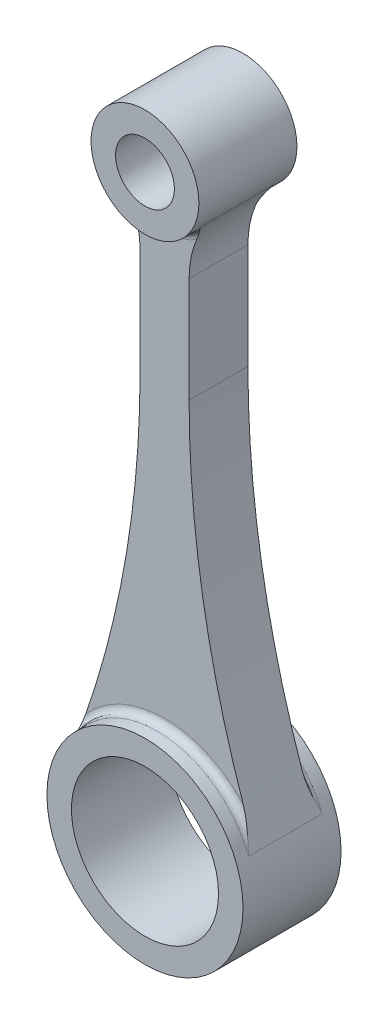
ISO-10303-21;
HEADER;
FILE_DESCRIPTION(('STEP AP214'),'2;1');
FILE_NAME('part.step','',(''),(''),'','','');
FILE_SCHEMA(('AUTOMOTIVE_DESIGN { 1 0 10303 214 1 1 1 1 }'));
ENDSEC;
DATA;
#1=APPLICATION_CONTEXT('core data for automotive mechanical design processes');
#2=APPLICATION_PROTOCOL_DEFINITION('international standard','automotive_design',2000,#1);
#3=PRODUCT_CONTEXT('',#1,'mechanical');
#4=PRODUCT('Part','Part','',(#3));
#5=PRODUCT_RELATED_PRODUCT_CATEGORY('part','',(#4));
#6=PRODUCT_DEFINITION_FORMATION('','',#4);
#7=PRODUCT_DEFINITION_CONTEXT('part definition',#1,'design');
#8=PRODUCT_DEFINITION('design','',#6,#7);
#9=PRODUCT_DEFINITION_SHAPE('','',#8);
#10=(LENGTH_UNIT() NAMED_UNIT(*) SI_UNIT(.MILLI.,.METRE.));
#11=(NAMED_UNIT(*) PLANE_ANGLE_UNIT() SI_UNIT($,.RADIAN.));
#12=(NAMED_UNIT(*) SI_UNIT($,.STERADIAN.) SOLID_ANGLE_UNIT());
#13=UNCERTAINTY_MEASURE_WITH_UNIT(LENGTH_MEASURE(1.E-05),#10,'distance_accuracy_value','');
#14=(GEOMETRIC_REPRESENTATION_CONTEXT(3) GLOBAL_UNCERTAINTY_ASSIGNED_CONTEXT((#13)) GLOBAL_UNIT_ASSIGNED_CONTEXT((#10,
#11,#12)) REPRESENTATION_CONTEXT('',''));
#15=CARTESIAN_POINT('',(0.,0.,0.));
#16=DIRECTION('',(0.,0.,1.));
#17=DIRECTION('',(1.,0.,0.));
#18=AXIS2_PLACEMENT_3D('',#15,#16,#17);
#19=CARTESIAN_POINT('',(0.,0.,10.));
#20=DIRECTION('',(0.,0.,1.));
#21=DIRECTION('',(1.,0.,0.));
#22=AXIS2_PLACEMENT_3D('',#19,#20,#21);
#23=PLANE('',#22);
#24=CARTESIAN_POINT('',(0.,0.,10.));
#25=DIRECTION('',(0.,0.,1.));
#26=DIRECTION('',(1.,0.,0.));
#27=AXIS2_PLACEMENT_3D('',#24,#25,#26);
#28=CIRCLE('',#27,20.);
#29=CARTESIAN_POINT('',(20.,0.,10.));
#30=VERTEX_POINT('',#29);
#31=EDGE_CURVE('E194',#30,#30,#28,.T.);
#32=ORIENTED_EDGE('',*,*,#31,.T.);
#33=EDGE_LOOP('',(#32));
#34=FACE_BOUND('',#33,.T.);
#35=CARTESIAN_POINT('',(0.,0.,10.));
#36=DIRECTION('',(0.,0.,1.));
#37=DIRECTION('',(1.,0.,0.));
#38=AXIS2_PLACEMENT_3D('',#35,#36,#37);
#39=CIRCLE('',#38,15.);
#40=CARTESIAN_POINT('',(15.,0.,10.));
#41=VERTEX_POINT('',#40);
#42=EDGE_CURVE('E188',#41,#41,#39,.T.);
#43=ORIENTED_EDGE('',*,*,#42,.F.);
#44=EDGE_LOOP('',(#43));
#45=FACE_BOUND('',#44,.T.);
#46=ADVANCED_FACE('F44',(#34,#45),#23,.T.);
#47=CARTESIAN_POINT('',(0.,0.,-10.));
#48=DIRECTION('',(0.,0.,1.));
#49=DIRECTION('',(1.,0.,0.));
#50=AXIS2_PLACEMENT_3D('',#47,#48,#49);
#51=PLANE('',#50);
#52=CARTESIAN_POINT('',(0.,0.,-10.));
#53=DIRECTION('',(0.,0.,1.));
#54=DIRECTION('',(1.,0.,0.));
#55=AXIS2_PLACEMENT_3D('',#52,#53,#54);
#56=CIRCLE('',#55,20.);
#57=CARTESIAN_POINT('',(20.,0.,-10.));
#58=VERTEX_POINT('',#57);
#59=EDGE_CURVE('E191',#58,#58,#56,.T.);
#60=ORIENTED_EDGE('',*,*,#59,.F.);
#61=EDGE_LOOP('',(#60));
#62=FACE_BOUND('',#61,.T.);
#63=CARTESIAN_POINT('',(0.,0.,-10.));
#64=DIRECTION('',(0.,0.,1.));
#65=DIRECTION('',(1.,0.,0.));
#66=AXIS2_PLACEMENT_3D('',#63,#64,#65);
#67=CIRCLE('',#66,15.);
#68=CARTESIAN_POINT('',(15.,0.,-10.));
#69=VERTEX_POINT('',#68);
#70=EDGE_CURVE('E160',#69,#69,#67,.T.);
#71=ORIENTED_EDGE('',*,*,#70,.T.);
#72=EDGE_LOOP('',(#71));
#73=FACE_BOUND('',#72,.T.);
#74=ADVANCED_FACE('F344',(#62,#73),#51,.F.);
#75=CARTESIAN_POINT('',(0.,0.,10.));
#76=DIRECTION('',(0.,0.,-1.));
#77=DIRECTION('',(-1.,0.,0.));
#78=AXIS2_PLACEMENT_3D('',#75,#76,#77);
#79=CYLINDRICAL_SURFACE('',#78,20.);
#80=CARTESIAN_POINT('',(0.,0.,7.5));
#81=DIRECTION('',(0.,0.,1.));
#82=DIRECTION('',(1.,0.,0.));
#83=AXIS2_PLACEMENT_3D('',#80,#81,#82);
#84=CIRCLE('',#83,20.);
#85=CARTESIAN_POINT('',(18.6481142651052,7.2282663450912,7.5));
#86=VERTEX_POINT('',#85);
#87=CARTESIAN_POINT('',(-18.6481142651052,7.2282663450912,7.5));
#88=VERTEX_POINT('',#87);
#89=EDGE_CURVE('E208',#86,#88,#84,.T.);
#90=ORIENTED_EDGE('',*,*,#89,.T.);
#91=DIRECTION('',(0.,0.,-1.));
#92=VECTOR('',#91,1.);
#93=CARTESIAN_POINT('',(-18.6481142651053,7.22826634509122,6.));
#94=LINE('',#93,#92);
#95=CARTESIAN_POINT('',(-18.6481142651052,7.2282663450912,-7.5));
#96=VERTEX_POINT('',#95);
#97=EDGE_CURVE('E161',#88,#96,#94,.T.);
#98=ORIENTED_EDGE('',*,*,#97,.T.);
#99=CARTESIAN_POINT('',(0.,0.,-7.5));
#100=DIRECTION('',(0.,0.,1.));
#101=DIRECTION('',(1.,0.,0.));
#102=AXIS2_PLACEMENT_3D('',#99,#100,#101);
#103=CIRCLE('',#102,20.);
#104=CARTESIAN_POINT('',(18.6481142651052,7.2282663450912,-7.5));
#105=VERTEX_POINT('',#104);
#106=EDGE_CURVE('E205',#96,#105,#103,.F.);
#107=ORIENTED_EDGE('',*,*,#106,.T.);
#108=DIRECTION('',(0.,0.,-1.));
#109=VECTOR('',#108,1.);
#110=CARTESIAN_POINT('',(18.6481142651052,7.2282663450912,6.));
#111=LINE('',#110,#109);
#112=EDGE_CURVE('E185',#86,#105,#111,.T.);
#113=ORIENTED_EDGE('',*,*,#112,.F.);
#114=EDGE_LOOP('',(#90,#98,#107,#113));
#115=FACE_BOUND('',#114,.T.);
#116=ORIENTED_EDGE('',*,*,#31,.F.);
#117=EDGE_LOOP('',(#116));
#118=FACE_BOUND('',#117,.T.);
#119=ORIENTED_EDGE('',*,*,#59,.T.);
#120=EDGE_LOOP('',(#119));
#121=FACE_BOUND('',#120,.T.);
#122=ADVANCED_FACE('F286',(#115,#118,#121),#79,.T.);
#123=CARTESIAN_POINT('',(0.,0.,10.));
#124=DIRECTION('',(0.,0.,-1.));
#125=DIRECTION('',(-1.,0.,0.));
#126=AXIS2_PLACEMENT_3D('',#123,#124,#125);
#127=CYLINDRICAL_SURFACE('',#126,15.);
#128=ORIENTED_EDGE('',*,*,#42,.T.);
#129=EDGE_LOOP('',(#128));
#130=FACE_BOUND('',#129,.T.);
#131=ORIENTED_EDGE('',*,*,#70,.F.);
#132=EDGE_LOOP('',(#131));
#133=FACE_BOUND('',#132,.T.);
#134=ADVANCED_FACE('F343',(#130,#133),#127,.F.);
#135=CARTESIAN_POINT('',(-4.99999999999999,0.,6.));
#136=DIRECTION('',(1.,0.,0.));
#137=DIRECTION('',(0.,1.,0.));
#138=AXIS2_PLACEMENT_3D('',#135,#136,#137);
#139=PLANE('',#138);
#140=DIRECTION('',(0.,-1.,0.));
#141=VECTOR('',#140,1.);
#142=CARTESIAN_POINT('',(-4.99999999999999,0.,6.));
#143=LINE('',#142,#141);
#144=CARTESIAN_POINT('',(-5.,101.669697220177,6.));
#145=VERTEX_POINT('',#144);
#146=CARTESIAN_POINT('',(-5.,80.2020410288673,6.));
#147=VERTEX_POINT('',#146);
#148=EDGE_CURVE('E139',#145,#147,#143,.T.);
#149=ORIENTED_EDGE('',*,*,#148,.F.);
#150=DIRECTION('',(0.,0.,1.));
#151=VECTOR('',#150,1.);
#152=CARTESIAN_POINT('',(-5.,101.669697220177,-7.5));
#153=LINE('',#152,#151);
#154=CARTESIAN_POINT('',(-5.,101.669697220177,-6.));
#155=VERTEX_POINT('',#154);
#156=EDGE_CURVE('E321',#145,#155,#153,.F.);
#157=ORIENTED_EDGE('',*,*,#156,.T.);
#158=DIRECTION('',(0.,-1.,0.));
#159=VECTOR('',#158,1.);
#160=CARTESIAN_POINT('',(-4.99999999999999,0.,-6.));
#161=LINE('',#160,#159);
#162=CARTESIAN_POINT('',(-5.,80.2020410288673,-6.));
#163=VERTEX_POINT('',#162);
#164=EDGE_CURVE('E156',#155,#163,#161,.T.);
#165=ORIENTED_EDGE('',*,*,#164,.T.);
#166=DIRECTION('',(0.,0.,-1.));
#167=VECTOR('',#166,1.);
#168=CARTESIAN_POINT('',(-5.,80.2020410288673,6.));
#169=LINE('',#168,#167);
#170=EDGE_CURVE('E153',#147,#163,#169,.T.);
#171=ORIENTED_EDGE('',*,*,#170,.F.);
#172=EDGE_LOOP('',(#149,#157,#165,#171));
#173=FACE_BOUND('',#172,.T.);
#174=ADVANCED_FACE('F154',(#173),#139,.F.);
#175=CARTESIAN_POINT('',(-206.912246173203,80.2020410288672,6.));
#176=DIRECTION('',(0.,0.,-1.));
#177=DIRECTION('',(-1.,0.,0.));
#178=AXIS2_PLACEMENT_3D('',#175,#176,#177);
#179=CYLINDRICAL_SURFACE('',#178,201.912246173203);
#180=CARTESIAN_POINT('',(-206.912246173203,80.2020410288672,-6.));
#181=DIRECTION('',(0.,0.,1.));
#182=DIRECTION('',(1.,0.,0.));
#183=AXIS2_PLACEMENT_3D('',#180,#181,#182);
#184=CIRCLE('',#183,201.912246173203);
#185=CARTESIAN_POINT('',(-16.0593915870727,14.2949621144324,-6.));
#186=VERTEX_POINT('',#185);
#187=EDGE_CURVE('E176',#163,#186,#184,.F.);
#188=ORIENTED_EDGE('',*,*,#187,.T.);
#189=CARTESIAN_POINT('',(-16.0593915870727,14.2949621144324,-6.));
#190=CARTESIAN_POINT('',(-16.1006536952666,14.1754753958456,-6.00001602232113));
#191=CARTESIAN_POINT('',(-16.1420221672799,14.0560452300231,-6.00236364174544));
#192=CARTESIAN_POINT('',(-16.2249250693908,13.8174294281519,-6.01122841546125));
#193=CARTESIAN_POINT('',(-16.2664594535393,13.6982437365956,-6.01774448543616));
#194=CARTESIAN_POINT('',(-16.3496188353412,13.4603293139342,-6.03444296750558));
#195=CARTESIAN_POINT('',(-16.3912436637868,13.3416002055112,-6.04462095780526));
#196=CARTESIAN_POINT('',(-16.47461435588,13.1045050433057,-6.06824871526173));
#197=CARTESIAN_POINT('',(-16.5163602282243,12.9861390169331,-6.08169872356161));
#198=CARTESIAN_POINT('',(-16.6413582816479,12.6327683299795,-6.12627700219539));
#199=CARTESIAN_POINT('',(-16.7247668152742,12.398358504783,-6.16172009800654));
#200=CARTESIAN_POINT('',(-16.8919587539825,11.931204626074,-6.24186223068277));
#201=CARTESIAN_POINT('',(-16.9757422854817,11.6984612159034,-6.28656466186993));
#202=CARTESIAN_POINT('',(-17.1890070534448,11.1094074843416,-6.40949821500744));
#203=CARTESIAN_POINT('',(-17.3187304550137,10.7542484759828,-6.49279850831349));
#204=CARTESIAN_POINT('',(-17.5791415039694,10.0474088872052,-6.67147800946811));
#205=CARTESIAN_POINT('',(-17.7098291679299,9.69572836681858,-6.76685742538887));
#206=CARTESIAN_POINT('',(-18.1041013686514,8.64365924994759,-7.06469767402643));
#207=CARTESIAN_POINT('',(-18.3695278193136,7.9472569079615,-7.27862120675387));
#208=CARTESIAN_POINT('',(-18.6418666749911,7.24438596708868,-7.49503656019241));
#209=CARTESIAN_POINT('',(-18.6449902140358,7.23632605190554,-7.49751829132755));
#210=CARTESIAN_POINT('',(-18.6481142651053,7.22826634509115,-7.5));
#211=B_SPLINE_CURVE_WITH_KNOTS('',3,(#189,#190,#191,#192,#193,#194,#195,#196,#197,#198,#199,
#200,#201,#202,#203,#204,#205,#206,#207,#208,#209,#210),.UNSPECIFIED.,.F.,.F.,(4,2,2,2,2,2,2,2,
2,2,4),(0.,0.379183324238735,0.758268053648098,1.13689656342593,1.5155529860453,
2.26926103822127,3.0232458780853,4.18443837654434,5.34565088015859,7.67138597053275,
7.69836558191348),.UNSPECIFIED.);
#212=EDGE_CURVE('E242',#186,#96,#211,.T.);
#213=ORIENTED_EDGE('',*,*,#212,.T.);
#214=ORIENTED_EDGE('',*,*,#97,.F.);
#215=CARTESIAN_POINT('',(-16.0593915870727,14.2949621144324,6.));
#216=CARTESIAN_POINT('',(-16.1006536952666,14.1754753958456,6.00001602232113));
#217=CARTESIAN_POINT('',(-16.1420221672799,14.0560452300231,6.00236364174544));
#218=CARTESIAN_POINT('',(-16.2249250693908,13.8174294281519,6.01122841546125));
#219=CARTESIAN_POINT('',(-16.2664594535393,13.6982437365956,6.01774448543616));
#220=CARTESIAN_POINT('',(-16.3496188353412,13.4603293139342,6.03444296750558));
#221=CARTESIAN_POINT('',(-16.3912436637868,13.3416002055112,6.04462095780526));
#222=CARTESIAN_POINT('',(-16.47461435588,13.1045050433057,6.06824871526173));
#223=CARTESIAN_POINT('',(-16.5163602282243,12.9861390169331,6.08169872356161));
#224=CARTESIAN_POINT('',(-16.6413582816479,12.6327683299795,6.12627700219539));
#225=CARTESIAN_POINT('',(-16.7247668152742,12.398358504783,6.16172009800653));
#226=CARTESIAN_POINT('',(-16.8919587539825,11.931204626074,6.24186223068277));
#227=CARTESIAN_POINT('',(-16.9757422854817,11.6984612159034,6.28656466186992));
#228=CARTESIAN_POINT('',(-17.1890070534448,11.1094074843416,6.40949821500744));
#229=CARTESIAN_POINT('',(-17.3187304550137,10.7542484759828,6.49279850831349));
#230=CARTESIAN_POINT('',(-17.5791415039694,10.0474088872052,6.67147800946811));
#231=CARTESIAN_POINT('',(-17.7098291679299,9.69572836681858,6.76685742538887));
#232=CARTESIAN_POINT('',(-18.1041013686514,8.64365924994759,7.06469767402643));
#233=CARTESIAN_POINT('',(-18.3695278193136,7.9472569079615,7.27862120675387));
#234=CARTESIAN_POINT('',(-18.6418666749911,7.24438596708868,7.4950365601924));
#235=CARTESIAN_POINT('',(-18.6449902140358,7.23632605190554,7.49751829132755));
#236=CARTESIAN_POINT('',(-18.6481142651053,7.22826634509115,7.5));
#237=B_SPLINE_CURVE_WITH_KNOTS('',3,(#215,#216,#217,#218,#219,#220,#221,#222,#223,#224,#225,
#226,#227,#228,#229,#230,#231,#232,#233,#234,#235,#236),.UNSPECIFIED.,.F.,.F.,(4,2,2,2,2,2,2,2,
2,2,4),(0.,0.379183324238733,0.758268053648098,1.13689656342593,1.5155529860453,
2.26926103822127,3.0232458780853,4.18443837654434,5.34565088015859,7.67138597053275,
7.69836558191348),.UNSPECIFIED.);
#238=CARTESIAN_POINT('',(-16.0593915870727,14.2949621144324,6.));
#239=VERTEX_POINT('',#238);
#240=EDGE_CURVE('E165',#88,#239,#237,.F.);
#241=ORIENTED_EDGE('',*,*,#240,.T.);
#242=CARTESIAN_POINT('',(-206.912246173203,80.2020410288672,6.));
#243=DIRECTION('',(0.,0.,1.));
#244=DIRECTION('',(1.,0.,0.));
#245=AXIS2_PLACEMENT_3D('',#242,#243,#244);
#246=CIRCLE('',#245,201.912246173203);
#247=EDGE_CURVE('E143',#147,#239,#246,.F.);
#248=ORIENTED_EDGE('',*,*,#247,.F.);
#249=ORIENTED_EDGE('',*,*,#170,.T.);
#250=EDGE_LOOP('',(#188,#213,#214,#241,#248,#249));
#251=FACE_BOUND('',#250,.T.);
#252=ADVANCED_FACE('F163',(#251),#179,.F.);
#253=CARTESIAN_POINT('',(206.912246173204,80.2020410288673,6.));
#254=DIRECTION('',(0.,0.,-1.));
#255=DIRECTION('',(-1.,0.,0.));
#256=AXIS2_PLACEMENT_3D('',#253,#254,#255);
#257=CYLINDRICAL_SURFACE('',#256,201.912246173204);
#258=CARTESIAN_POINT('',(206.912246173204,80.2020410288673,-6.));
#259=DIRECTION('',(0.,0.,1.));
#260=DIRECTION('',(1.,0.,0.));
#261=AXIS2_PLACEMENT_3D('',#258,#259,#260);
#262=CIRCLE('',#261,201.912246173204);
#263=CARTESIAN_POINT('',(5.,80.2020410288673,-6.));
#264=VERTEX_POINT('',#263);
#265=CARTESIAN_POINT('',(16.0593915870727,14.2949621144324,-6.));
#266=VERTEX_POINT('',#265);
#267=EDGE_CURVE('E179',#264,#266,#262,.T.);
#268=ORIENTED_EDGE('',*,*,#267,.F.);
#269=DIRECTION('',(0.,0.,-1.));
#270=VECTOR('',#269,1.);
#271=CARTESIAN_POINT('',(5.,80.2020410288673,6.));
#272=LINE('',#271,#270);
#273=CARTESIAN_POINT('',(5.,80.2020410288673,6.));
#274=VERTEX_POINT('',#273);
#275=EDGE_CURVE('E174',#274,#264,#272,.T.);
#276=ORIENTED_EDGE('',*,*,#275,.F.);
#277=CARTESIAN_POINT('',(206.912246173204,80.2020410288673,6.));
#278=DIRECTION('',(0.,0.,1.));
#279=DIRECTION('',(1.,0.,0.));
#280=AXIS2_PLACEMENT_3D('',#277,#278,#279);
#281=CIRCLE('',#280,201.912246173204);
#282=CARTESIAN_POINT('',(16.0593915870727,14.2949621144324,6.));
#283=VERTEX_POINT('',#282);
#284=EDGE_CURVE('E166',#274,#283,#281,.T.);
#285=ORIENTED_EDGE('',*,*,#284,.T.);
#286=CARTESIAN_POINT('',(16.0593915870727,14.2949621144324,6.));
#287=CARTESIAN_POINT('',(16.1006536952668,14.1754753958448,6.00001602232113));
#288=CARTESIAN_POINT('',(16.1420221672804,14.0560452300214,6.00236364174548));
#289=CARTESIAN_POINT('',(16.224925069392,13.8174294281485,6.01122841546141));
#290=CARTESIAN_POINT('',(16.2664594535408,13.6982437365913,6.01774448543641));
#291=CARTESIAN_POINT('',(16.3496188353432,13.4603293139284,6.03444296750605));
#292=CARTESIAN_POINT('',(16.3912436637891,13.3416002055047,6.04462095780585));
#293=CARTESIAN_POINT('',(16.4746143558828,13.1045050432978,6.06824871526259));
#294=CARTESIAN_POINT('',(16.5163602282273,12.9861390169245,6.0816987235626));
#295=CARTESIAN_POINT('',(16.6413582816506,12.632768329972,6.12627700219653));
#296=CARTESIAN_POINT('',(16.7247668152762,12.3983585047771,6.16172009800762));
#297=CARTESIAN_POINT('',(16.8919587539835,11.9312046260712,6.24186223068323));
#298=CARTESIAN_POINT('',(16.9757422854822,11.6984612159019,6.28656466186983));
#299=CARTESIAN_POINT('',(17.1890070534447,11.109407484342,6.40949821500801));
#300=CARTESIAN_POINT('',(17.3187304550132,10.754248475984,6.49279850831627));
#301=CARTESIAN_POINT('',(17.5791415039692,10.0474088872057,6.67147800946501));
#302=CARTESIAN_POINT('',(17.7098291679302,9.69572836681758,6.76685742537764));
#303=CARTESIAN_POINT('',(18.1041013686486,8.6436592499549,7.06469767404762));
#304=CARTESIAN_POINT('',(18.3695278193012,7.94725690799374,7.27862120687208));
#305=CARTESIAN_POINT('',(18.6418666749909,7.24438596708913,7.49503656019523));
#306=CARTESIAN_POINT('',(18.6449902140357,7.23632605190576,7.49751829132897));
#307=CARTESIAN_POINT('',(18.6481142651053,7.22826634509113,7.5));
#308=B_SPLINE_CURVE_WITH_KNOTS('',3,(#286,#287,#288,#289,#290,#291,#292,#293,#294,#295,#296,
#297,#298,#299,#300,#301,#302,#303,#304,#305,#306,#307),.UNSPECIFIED.,.F.,.F.,(4,2,2,2,2,2,2,2,
2,2,4),(0.,0.379183324241492,0.75826805365362,1.13689656343362,1.51555298605515,
2.26926103822587,3.0232458780853,4.18443837654368,5.34565088015587,7.67138597053323,
7.6983655819135),.UNSPECIFIED.);
#309=EDGE_CURVE('E223',#283,#86,#308,.T.);
#310=ORIENTED_EDGE('',*,*,#309,.T.);
#311=ORIENTED_EDGE('',*,*,#112,.T.);
#312=CARTESIAN_POINT('',(16.0593915870727,14.2949621144324,-6.));
#313=CARTESIAN_POINT('',(16.1006536952668,14.1754753958448,-6.00001602232113));
#314=CARTESIAN_POINT('',(16.1420221672804,14.0560452300214,-6.00236364174548));
#315=CARTESIAN_POINT('',(16.224925069392,13.8174294281485,-6.01122841546141));
#316=CARTESIAN_POINT('',(16.2664594535408,13.6982437365913,-6.01774448543641));
#317=CARTESIAN_POINT('',(16.3496188353432,13.4603293139284,-6.03444296750605));
#318=CARTESIAN_POINT('',(16.3912436637891,13.3416002055047,-6.04462095780585));
#319=CARTESIAN_POINT('',(16.4746143558828,13.1045050432978,-6.06824871526259));
#320=CARTESIAN_POINT('',(16.5163602282273,12.9861390169245,-6.0816987235626));
#321=CARTESIAN_POINT('',(16.6413582816506,12.632768329972,-6.12627700219653));
#322=CARTESIAN_POINT('',(16.7247668152762,12.3983585047771,-6.16172009800762));
#323=CARTESIAN_POINT('',(16.8919587539835,11.9312046260712,-6.24186223068324));
#324=CARTESIAN_POINT('',(16.9757422854822,11.6984612159019,-6.28656466186983));
#325=CARTESIAN_POINT('',(17.1890070534447,11.109407484342,-6.40949821500801));
#326=CARTESIAN_POINT('',(17.3187304550132,10.754248475984,-6.49279850831627));
#327=CARTESIAN_POINT('',(17.5791415039692,10.0474088872057,-6.67147800946501));
#328=CARTESIAN_POINT('',(17.7098291679302,9.69572836681758,-6.76685742537764));
#329=CARTESIAN_POINT('',(18.1041013686486,8.6436592499549,-7.06469767404762));
#330=CARTESIAN_POINT('',(18.3695278193012,7.94725690799374,-7.27862120687208));
#331=CARTESIAN_POINT('',(18.6418666749909,7.24438596708913,-7.49503656019523));
#332=CARTESIAN_POINT('',(18.6449902140357,7.23632605190576,-7.49751829132897));
#333=CARTESIAN_POINT('',(18.6481142651053,7.22826634509113,-7.5));
#334=B_SPLINE_CURVE_WITH_KNOTS('',3,(#312,#313,#314,#315,#316,#317,#318,#319,#320,#321,#322,
#323,#324,#325,#326,#327,#328,#329,#330,#331,#332,#333),.UNSPECIFIED.,.F.,.F.,(4,2,2,2,2,2,2,2,
2,2,4),(0.,0.379183324241492,0.75826805365362,1.13689656343362,1.51555298605515,
2.26926103822587,3.0232458780853,4.18443837654368,5.34565088015587,7.67138597053323,
7.6983655819135),.UNSPECIFIED.);
#335=EDGE_CURVE('E249',#105,#266,#334,.F.);
#336=ORIENTED_EDGE('',*,*,#335,.T.);
#337=EDGE_LOOP('',(#268,#276,#285,#310,#311,#336));
#338=FACE_BOUND('',#337,.T.);
#339=ADVANCED_FACE('F237',(#338),#257,.F.);
#340=CARTESIAN_POINT('',(5.00000000000001,0.,6.));
#341=DIRECTION('',(1.,0.,0.));
#342=DIRECTION('',(0.,1.,0.));
#343=AXIS2_PLACEMENT_3D('',#340,#341,#342);
#344=PLANE('',#343);
#345=DIRECTION('',(0.,-1.,0.));
#346=VECTOR('',#345,1.);
#347=CARTESIAN_POINT('',(5.00000000000001,0.,-6.));
#348=LINE('',#347,#346);
#349=CARTESIAN_POINT('',(5.,101.669697220177,-6.));
#350=VERTEX_POINT('',#349);
#351=EDGE_CURVE('E150',#350,#264,#348,.T.);
#352=ORIENTED_EDGE('',*,*,#351,.F.);
#353=DIRECTION('',(0.,0.,-1.));
#354=VECTOR('',#353,1.);
#355=CARTESIAN_POINT('',(5.,101.669697220177,6.));
#356=LINE('',#355,#354);
#357=CARTESIAN_POINT('',(5.,101.669697220177,6.));
#358=VERTEX_POINT('',#357);
#359=EDGE_CURVE('E319',#350,#358,#356,.F.);
#360=ORIENTED_EDGE('',*,*,#359,.T.);
#361=DIRECTION('',(0.,-1.,0.));
#362=VECTOR('',#361,1.);
#363=CARTESIAN_POINT('',(5.00000000000001,0.,6.));
#364=LINE('',#363,#362);
#365=EDGE_CURVE('E169',#358,#274,#364,.T.);
#366=ORIENTED_EDGE('',*,*,#365,.T.);
#367=ORIENTED_EDGE('',*,*,#275,.T.);
#368=EDGE_LOOP('',(#352,#360,#366,#367));
#369=FACE_BOUND('',#368,.T.);
#370=ADVANCED_FACE('F329',(#369),#344,.T.);
#371=CARTESIAN_POINT('',(0.,0.,6.));
#372=DIRECTION('',(0.,0.,1.));
#373=DIRECTION('',(1.,0.,0.));
#374=AXIS2_PLACEMENT_3D('',#371,#372,#373);
#375=PLANE('',#374);
#376=ORIENTED_EDGE('',*,*,#247,.T.);
#377=CARTESIAN_POINT('',(0.,0.,6.));
#378=DIRECTION('',(0.,0.,1.));
#379=DIRECTION('',(1.,0.,0.));
#380=AXIS2_PLACEMENT_3D('',#377,#378,#379);
#381=CIRCLE('',#380,21.5);
#382=EDGE_CURVE('E211',#239,#283,#381,.F.);
#383=ORIENTED_EDGE('',*,*,#382,.T.);
#384=ORIENTED_EDGE('',*,*,#284,.F.);
#385=ORIENTED_EDGE('',*,*,#365,.F.);
#386=CARTESIAN_POINT('',(25.,101.669697220177,6.));
#387=DIRECTION('',(0.,0.,1.));
#388=DIRECTION('',(1.,0.,0.));
#389=AXIS2_PLACEMENT_3D('',#386,#387,#388);
#390=CIRCLE('',#389,20.);
#391=CARTESIAN_POINT('',(6.52976453851341,109.341098786856,6.));
#392=VERTEX_POINT('',#391);
#393=EDGE_CURVE('E58',#358,#392,#390,.F.);
#394=ORIENTED_EDGE('',*,*,#393,.T.);
#395=CARTESIAN_POINT('',(0.,120.,6.));
#396=DIRECTION('',(0.,0.,1.));
#397=DIRECTION('',(1.,0.,0.));
#398=AXIS2_PLACEMENT_3D('',#395,#396,#397);
#399=CIRCLE('',#398,12.5);
#400=CARTESIAN_POINT('',(-6.52976453851342,109.341098786856,6.));
#401=VERTEX_POINT('',#400);
#402=EDGE_CURVE('E64',#392,#401,#399,.F.);
#403=ORIENTED_EDGE('',*,*,#402,.T.);
#404=CARTESIAN_POINT('',(-25.,101.669697220177,6.));
#405=DIRECTION('',(0.,0.,1.));
#406=DIRECTION('',(1.,0.,0.));
#407=AXIS2_PLACEMENT_3D('',#404,#405,#406);
#408=CIRCLE('',#407,20.);
#409=EDGE_CURVE('E146',#401,#145,#408,.F.);
#410=ORIENTED_EDGE('',*,*,#409,.T.);
#411=ORIENTED_EDGE('',*,*,#148,.T.);
#412=EDGE_LOOP('',(#376,#383,#384,#385,#394,#403,#410,#411));
#413=FACE_BOUND('',#412,.T.);
#414=ADVANCED_FACE('F141',(#413),#375,.T.);
#415=CARTESIAN_POINT('',(0.,0.,-6.));
#416=DIRECTION('',(0.,0.,1.));
#417=DIRECTION('',(1.,0.,0.));
#418=AXIS2_PLACEMENT_3D('',#415,#416,#417);
#419=PLANE('',#418);
#420=ORIENTED_EDGE('',*,*,#267,.T.);
#421=CARTESIAN_POINT('',(0.,0.,-6.));
#422=DIRECTION('',(0.,0.,1.));
#423=DIRECTION('',(1.,0.,0.));
#424=AXIS2_PLACEMENT_3D('',#421,#422,#423);
#425=CIRCLE('',#424,21.5);
#426=EDGE_CURVE('E213',#266,#186,#425,.T.);
#427=ORIENTED_EDGE('',*,*,#426,.T.);
#428=ORIENTED_EDGE('',*,*,#187,.F.);
#429=ORIENTED_EDGE('',*,*,#164,.F.);
#430=CARTESIAN_POINT('',(-25.,101.669697220177,-6.));
#431=DIRECTION('',(0.,0.,1.));
#432=DIRECTION('',(1.,0.,0.));
#433=AXIS2_PLACEMENT_3D('',#430,#431,#432);
#434=CIRCLE('',#433,20.);
#435=CARTESIAN_POINT('',(-6.52976453851342,109.341098786856,-6.));
#436=VERTEX_POINT('',#435);
#437=EDGE_CURVE('E322',#155,#436,#434,.T.);
#438=ORIENTED_EDGE('',*,*,#437,.T.);
#439=CARTESIAN_POINT('',(0.,120.,-6.));
#440=DIRECTION('',(0.,0.,1.));
#441=DIRECTION('',(1.,0.,0.));
#442=AXIS2_PLACEMENT_3D('',#439,#440,#441);
#443=CIRCLE('',#442,12.5);
#444=CARTESIAN_POINT('',(6.52976453851341,109.341098786856,-6.));
#445=VERTEX_POINT('',#444);
#446=EDGE_CURVE('E72',#436,#445,#443,.T.);
#447=ORIENTED_EDGE('',*,*,#446,.T.);
#448=CARTESIAN_POINT('',(25.,101.669697220177,-6.));
#449=DIRECTION('',(0.,0.,1.));
#450=DIRECTION('',(1.,0.,0.));
#451=AXIS2_PLACEMENT_3D('',#448,#449,#450);
#452=CIRCLE('',#451,20.);
#453=EDGE_CURVE('E299',#445,#350,#452,.T.);
#454=ORIENTED_EDGE('',*,*,#453,.T.);
#455=ORIENTED_EDGE('',*,*,#351,.T.);
#456=EDGE_LOOP('',(#420,#427,#428,#429,#438,#447,#454,#455));
#457=FACE_BOUND('',#456,.T.);
#458=ADVANCED_FACE('F327',(#457),#419,.F.);
#459=CARTESIAN_POINT('',(0.,120.,10.));
#460=DIRECTION('',(0.,0.,1.));
#461=DIRECTION('',(1.,0.,0.));
#462=AXIS2_PLACEMENT_3D('',#459,#460,#461);
#463=PLANE('',#462);
#464=CARTESIAN_POINT('',(0.,120.,10.));
#465=DIRECTION('',(0.,0.,1.));
#466=DIRECTION('',(1.,0.,0.));
#467=AXIS2_PLACEMENT_3D('',#464,#465,#466);
#468=CIRCLE('',#467,11.);
#469=CARTESIAN_POINT('',(11.,120.,10.));
#470=VERTEX_POINT('',#469);
#471=EDGE_CURVE('E511',#470,#470,#468,.T.);
#472=ORIENTED_EDGE('',*,*,#471,.T.);
#473=EDGE_LOOP('',(#472));
#474=FACE_BOUND('',#473,.T.);
#475=CARTESIAN_POINT('',(0.,120.,10.));
#476=DIRECTION('',(0.,0.,1.));
#477=DIRECTION('',(1.,0.,0.));
#478=AXIS2_PLACEMENT_3D('',#475,#476,#477);
#479=CIRCLE('',#478,6.00000000000002);
#480=CARTESIAN_POINT('',(6.00000000000002,120.,10.));
#481=VERTEX_POINT('',#480);
#482=EDGE_CURVE('E504',#481,#481,#479,.T.);
#483=ORIENTED_EDGE('',*,*,#482,.F.);
#484=EDGE_LOOP('',(#483));
#485=FACE_BOUND('',#484,.T.);
#486=ADVANCED_FACE('F388',(#474,#485),#463,.T.);
#487=CARTESIAN_POINT('',(0.,120.,-10.));
#488=DIRECTION('',(0.,0.,1.));
#489=DIRECTION('',(1.,0.,0.));
#490=AXIS2_PLACEMENT_3D('',#487,#488,#489);
#491=PLANE('',#490);
#492=CARTESIAN_POINT('',(0.,120.,-10.));
#493=DIRECTION('',(0.,0.,1.));
#494=DIRECTION('',(1.,0.,0.));
#495=AXIS2_PLACEMENT_3D('',#492,#493,#494);
#496=CIRCLE('',#495,11.);
#497=CARTESIAN_POINT('',(11.,120.,-10.));
#498=VERTEX_POINT('',#497);
#499=EDGE_CURVE('E509',#498,#498,#496,.T.);
#500=ORIENTED_EDGE('',*,*,#499,.F.);
#501=EDGE_LOOP('',(#500));
#502=FACE_BOUND('',#501,.T.);
#503=CARTESIAN_POINT('',(0.,120.,-10.));
#504=DIRECTION('',(0.,0.,1.));
#505=DIRECTION('',(1.,0.,0.));
#506=AXIS2_PLACEMENT_3D('',#503,#504,#505);
#507=CIRCLE('',#506,6.00000000000002);
#508=CARTESIAN_POINT('',(6.00000000000002,120.,-10.));
#509=VERTEX_POINT('',#508);
#510=EDGE_CURVE('E177',#509,#509,#507,.T.);
#511=ORIENTED_EDGE('',*,*,#510,.T.);
#512=EDGE_LOOP('',(#511));
#513=FACE_BOUND('',#512,.T.);
#514=ADVANCED_FACE('F392',(#502,#513),#491,.F.);
#515=CARTESIAN_POINT('',(0.,120.,10.));
#516=DIRECTION('',(0.,0.,-1.));
#517=DIRECTION('',(-1.,0.,0.));
#518=AXIS2_PLACEMENT_3D('',#515,#516,#517);
#519=CYLINDRICAL_SURFACE('',#518,11.);
#520=CARTESIAN_POINT('',(0.,120.,-7.5));
#521=DIRECTION('',(0.,0.,1.));
#522=DIRECTION('',(1.,0.,0.));
#523=AXIS2_PLACEMENT_3D('',#520,#521,#522);
#524=CIRCLE('',#523,11.);
#525=CARTESIAN_POINT('',(8.87096774193549,113.495699013611,-7.5));
#526=VERTEX_POINT('',#525);
#527=CARTESIAN_POINT('',(-8.87096774193549,113.495699013611,-7.5));
#528=VERTEX_POINT('',#527);
#529=EDGE_CURVE('E203',#526,#528,#524,.F.);
#530=ORIENTED_EDGE('',*,*,#529,.T.);
#531=DIRECTION('',(0.,0.,-1.));
#532=VECTOR('',#531,1.);
#533=CARTESIAN_POINT('',(-8.87096774193549,113.495699013611,10.));
#534=LINE('',#533,#532);
#535=CARTESIAN_POINT('',(-8.87096774193549,113.495699013611,7.5));
#536=VERTEX_POINT('',#535);
#537=EDGE_CURVE('E314',#528,#536,#534,.F.);
#538=ORIENTED_EDGE('',*,*,#537,.T.);
#539=CARTESIAN_POINT('',(0.,120.,7.5));
#540=DIRECTION('',(0.,0.,1.));
#541=DIRECTION('',(1.,0.,0.));
#542=AXIS2_PLACEMENT_3D('',#539,#540,#541);
#543=CIRCLE('',#542,11.);
#544=CARTESIAN_POINT('',(8.87096774193549,113.495699013611,7.5));
#545=VERTEX_POINT('',#544);
#546=EDGE_CURVE('E197',#536,#545,#543,.T.);
#547=ORIENTED_EDGE('',*,*,#546,.T.);
#548=DIRECTION('',(0.,0.,-1.));
#549=VECTOR('',#548,1.);
#550=CARTESIAN_POINT('',(8.87096774193549,113.495699013611,10.));
#551=LINE('',#550,#549);
#552=EDGE_CURVE('E309',#545,#526,#551,.T.);
#553=ORIENTED_EDGE('',*,*,#552,.T.);
#554=EDGE_LOOP('',(#530,#538,#547,#553));
#555=FACE_BOUND('',#554,.T.);
#556=ORIENTED_EDGE('',*,*,#471,.F.);
#557=EDGE_LOOP('',(#556));
#558=FACE_BOUND('',#557,.T.);
#559=ORIENTED_EDGE('',*,*,#499,.T.);
#560=EDGE_LOOP('',(#559));
#561=FACE_BOUND('',#560,.T.);
#562=ADVANCED_FACE('F315',(#555,#558,#561),#519,.T.);
#563=CARTESIAN_POINT('',(0.,120.,10.));
#564=DIRECTION('',(0.,0.,-1.));
#565=DIRECTION('',(-1.,0.,0.));
#566=AXIS2_PLACEMENT_3D('',#563,#564,#565);
#567=CYLINDRICAL_SURFACE('',#566,6.00000000000002);
#568=ORIENTED_EDGE('',*,*,#482,.T.);
#569=EDGE_LOOP('',(#568));
#570=FACE_BOUND('',#569,.T.);
#571=ORIENTED_EDGE('',*,*,#510,.F.);
#572=EDGE_LOOP('',(#571));
#573=FACE_BOUND('',#572,.T.);
#574=ADVANCED_FACE('F285',(#570,#573),#567,.F.);
#575=CARTESIAN_POINT('',(0.,120.,7.5));
#576=DIRECTION('',(0.,0.,1.));
#577=DIRECTION('',(1.,0.,0.));
#578=AXIS2_PLACEMENT_3D('',#575,#576,#577);
#579=TOROIDAL_SURFACE('',#578,12.5,1.5);
#580=ORIENTED_EDGE('',*,*,#546,.F.);
#581=CARTESIAN_POINT('',(-6.52976453851341,109.341098786856,6.));
#582=CARTESIAN_POINT('',(-6.56118335819651,109.416747920779,6.00000925177807));
#583=CARTESIAN_POINT('',(-6.59305602448863,109.492171876019,6.00231164516611));
#584=CARTESIAN_POINT('',(-6.65761775350335,109.64238075418,6.01103347793265));
#585=CARTESIAN_POINT('',(-6.69030631753766,109.717166031682,6.01745045890389));
#586=CARTESIAN_POINT('',(-6.78931397381746,109.939961264203,6.04212441147744));
#587=CARTESIAN_POINT('',(-6.85676792440683,110.086874644219,6.06581023051482));
#588=CARTESIAN_POINT('',(-6.99350158938923,110.375515680495,6.12436470006756));
#589=CARTESIAN_POINT('',(-7.062754344127,110.517281815677,6.15911205278929));
#590=CARTESIAN_POINT('',(-7.20358444297678,110.79724701459,6.23760984310522));
#591=CARTESIAN_POINT('',(-7.27516380163194,110.935442790442,6.28136826800821));
#592=CARTESIAN_POINT('',(-7.46301782611862,111.288135152223,6.40371242923487));
#593=CARTESIAN_POINT('',(-7.58090625694679,111.499893338872,6.48768150142437));
#594=CARTESIAN_POINT('',(-7.82184465737951,111.915117050018,6.66761005920634));
#595=CARTESIAN_POINT('',(-7.94489547396871,112.118581202842,6.76357151752212));
#596=CARTESIAN_POINT('',(-8.19678616505599,112.519035660713,6.96327814534879));
#597=CARTESIAN_POINT('',(-8.32564406752578,112.716001970417,7.06704833575391));
#598=CARTESIAN_POINT('',(-8.58921706524222,113.103908169924,7.27819082606951));
#599=CARTESIAN_POINT('',(-8.72393100109011,113.294849239822,7.38556241200982));
#600=CARTESIAN_POINT('',(-8.86493484363064,113.487467664241,7.49530812204766));
#601=CARTESIAN_POINT('',(-8.8679505095688,113.49158391814,7.49765406358596));
#602=CARTESIAN_POINT('',(-8.87096774193549,113.495699013611,7.5));
#603=B_SPLINE_CURVE_WITH_KNOTS('',3,(#581,#582,#583,#584,#585,#586,#587,#588,#589,#590,#591,
#592,#593,#594,#595,#596,#597,#598,#599,#600,#601,#602),.UNSPECIFIED.,.F.,.F.,(4,2,2,2,2,2,2,2,
2,2,4),(0.,0.245656008912615,0.491165378467292,0.98068293711896,1.46500748572488,
1.94976319620688,2.71855630954766,3.4874760546799,4.25897409193283,5.03032007474102,
5.04716854660824),.UNSPECIFIED.);
#604=EDGE_CURVE('E273',#536,#401,#603,.F.);
#605=ORIENTED_EDGE('',*,*,#604,.T.);
#606=ORIENTED_EDGE('',*,*,#402,.F.);
#607=CARTESIAN_POINT('',(6.52976453851341,109.341098786856,6.));
#608=CARTESIAN_POINT('',(6.56118335819656,109.416747920779,6.00000925177807));
#609=CARTESIAN_POINT('',(6.59305602448875,109.492171876019,6.00231164516612));
#610=CARTESIAN_POINT('',(6.6576177535036,109.64238075418,6.0110334779327));
#611=CARTESIAN_POINT('',(6.69030631753799,109.717166031683,6.01745045890396));
#612=CARTESIAN_POINT('',(6.78931397381797,109.939961264204,6.04212441147759));
#613=CARTESIAN_POINT('',(6.85676792440746,110.08687464422,6.06581023051506));
#614=CARTESIAN_POINT('',(6.99350158938985,110.375515680496,6.12436470006786));
#615=CARTESIAN_POINT('',(7.06275434412749,110.517281815678,6.15911205278955));
#616=CARTESIAN_POINT('',(7.20358444297701,110.79724701459,6.23760984310537));
#617=CARTESIAN_POINT('',(7.27516380163205,110.935442790442,6.2813682680083));
#618=CARTESIAN_POINT('',(7.4630178261186,111.288135152223,6.40371242923482));
#619=CARTESIAN_POINT('',(7.58090625694678,111.499893338872,6.48768150142419));
#620=CARTESIAN_POINT('',(7.82184465737934,111.915117050017,6.66761005920639));
#621=CARTESIAN_POINT('',(7.94489547396837,112.118581202841,6.7635715175225));
#622=CARTESIAN_POINT('',(8.19678616505592,112.519035660713,6.96327814534808));
#623=CARTESIAN_POINT('',(8.32564406752616,112.716001970418,7.06704833575177));
#624=CARTESIAN_POINT('',(8.58921706524158,113.103908169923,7.27819082607145));
#625=CARTESIAN_POINT('',(8.72393100108802,113.294849239819,7.38556241201726));
#626=CARTESIAN_POINT('',(8.86493484363058,113.487467664241,7.49530812204801));
#627=CARTESIAN_POINT('',(8.86795050956877,113.49158391814,7.49765406358614));
#628=CARTESIAN_POINT('',(8.87096774193549,113.495699013611,7.5));
#629=B_SPLINE_CURVE_WITH_KNOTS('',3,(#607,#608,#609,#610,#611,#612,#613,#614,#615,#616,#617,
#618,#619,#620,#621,#622,#623,#624,#625,#626,#627,#628),.UNSPECIFIED.,.F.,.F.,(4,2,2,2,2,2,2,2,
2,2,4),(0.,0.245656008913112,0.491165378468298,0.980682937120767,1.46500748572569,
1.94976319620688,2.71855630954753,3.48747605467939,4.25897409193257,5.03032007474112,
5.04716854660825),.UNSPECIFIED.);
#630=EDGE_CURVE('E11',#392,#545,#629,.T.);
#631=ORIENTED_EDGE('',*,*,#630,.T.);
#632=EDGE_LOOP('',(#580,#605,#606,#631));
#633=FACE_BOUND('',#632,.T.);
#634=ADVANCED_FACE('F280',(#633),#579,.F.);
#635=CARTESIAN_POINT('',(0.,120.,-7.5));
#636=DIRECTION('',(0.,0.,1.));
#637=DIRECTION('',(1.,0.,0.));
#638=AXIS2_PLACEMENT_3D('',#635,#636,#637);
#639=TOROIDAL_SURFACE('',#638,12.5,1.5);
#640=ORIENTED_EDGE('',*,*,#446,.F.);
#641=CARTESIAN_POINT('',(-6.52976453851341,109.341098786856,-6.));
#642=CARTESIAN_POINT('',(-6.56118335819646,109.416747920779,-6.00000925177808));
#643=CARTESIAN_POINT('',(-6.59305602448854,109.492171876019,-6.00231164516611));
#644=CARTESIAN_POINT('',(-6.65761775350315,109.642380754179,-6.01103347793262));
#645=CARTESIAN_POINT('',(-6.69030631753742,109.717166031682,-6.01745045890384));
#646=CARTESIAN_POINT('',(-6.78931397381709,109.939961264202,-6.04212441147733));
#647=CARTESIAN_POINT('',(-6.85676792440638,110.086874644218,-6.06581023051466));
#648=CARTESIAN_POINT('',(-6.99350158938878,110.375515680494,-6.12436470006734));
#649=CARTESIAN_POINT('',(-7.06275434412664,110.517281815677,-6.15911205278911));
#650=CARTESIAN_POINT('',(-7.2035844429766,110.797247014589,-6.23760984310511));
#651=CARTESIAN_POINT('',(-7.27516380163186,110.935442790441,-6.28136826800814));
#652=CARTESIAN_POINT('',(-7.46301782611863,111.288135152223,-6.4037124292349));
#653=CARTESIAN_POINT('',(-7.58090625694679,111.499893338872,-6.48768150142448));
#654=CARTESIAN_POINT('',(-7.82184465737963,111.915117050018,-6.66761005920632));
#655=CARTESIAN_POINT('',(-7.94489547396896,112.118581202842,-6.76357151752186));
#656=CARTESIAN_POINT('',(-8.19678616505607,112.519035660713,-6.96327814534929));
#657=CARTESIAN_POINT('',(-8.32564406752557,112.716001970417,-7.06704833575539));
#658=CARTESIAN_POINT('',(-8.58921706524265,113.103908169925,-7.2781908260682));
#659=CARTESIAN_POINT('',(-8.72393100109149,113.294849239824,-7.38556241200474));
#660=CARTESIAN_POINT('',(-8.86493484363069,113.487467664241,-7.49530812204743));
#661=CARTESIAN_POINT('',(-8.86795050956883,113.49158391814,-7.49765406358585));
#662=CARTESIAN_POINT('',(-8.87096774193549,113.495699013611,-7.5));
#663=B_SPLINE_CURVE_WITH_KNOTS('',3,(#641,#642,#643,#644,#645,#646,#647,#648,#649,#650,#651,
#652,#653,#654,#655,#656,#657,#658,#659,#660,#661,#662),.UNSPECIFIED.,.F.,.F.,(4,2,2,2,2,2,2,2,
2,2,4),(0.,0.245656008912251,0.491165378466575,0.980682937117696,1.46500748572427,
1.94976319620688,2.71855630954774,3.48747605468031,4.25897409193305,5.03032007474099,
5.04716854660824),.UNSPECIFIED.);
#664=EDGE_CURVE('E266',#436,#528,#663,.T.);
#665=ORIENTED_EDGE('',*,*,#664,.T.);
#666=ORIENTED_EDGE('',*,*,#529,.F.);
#667=CARTESIAN_POINT('',(6.52976453851341,109.341098786856,-6.));
#668=CARTESIAN_POINT('',(6.56118335819656,109.416747920779,-6.00000925177808));
#669=CARTESIAN_POINT('',(6.59305602448875,109.492171876019,-6.00231164516612));
#670=CARTESIAN_POINT('',(6.6576177535036,109.64238075418,-6.0110334779327));
#671=CARTESIAN_POINT('',(6.69030631753799,109.717166031683,-6.01745045890396));
#672=CARTESIAN_POINT('',(6.78931397381797,109.939961264204,-6.0421244114776));
#673=CARTESIAN_POINT('',(6.85676792440746,110.08687464422,-6.06581023051506));
#674=CARTESIAN_POINT('',(6.99350158938985,110.375515680496,-6.12436470006786));
#675=CARTESIAN_POINT('',(7.06275434412749,110.517281815678,-6.15911205278955));
#676=CARTESIAN_POINT('',(7.20358444297701,110.79724701459,-6.23760984310537));
#677=CARTESIAN_POINT('',(7.27516380163205,110.935442790442,-6.2813682680083));
#678=CARTESIAN_POINT('',(7.4630178261186,111.288135152223,-6.40371242923482));
#679=CARTESIAN_POINT('',(7.58090625694678,111.499893338872,-6.4876815014242));
#680=CARTESIAN_POINT('',(7.82184465737934,111.915117050017,-6.66761005920639));
#681=CARTESIAN_POINT('',(7.94489547396837,112.118581202841,-6.7635715175225));
#682=CARTESIAN_POINT('',(8.19678616505592,112.519035660713,-6.96327814534808));
#683=CARTESIAN_POINT('',(8.32564406752616,112.716001970418,-7.06704833575177));
#684=CARTESIAN_POINT('',(8.58921706524158,113.103908169923,-7.27819082607145));
#685=CARTESIAN_POINT('',(8.72393100108802,113.294849239819,-7.38556241201726));
#686=CARTESIAN_POINT('',(8.86493484363058,113.487467664241,-7.49530812204801));
#687=CARTESIAN_POINT('',(8.86795050956877,113.49158391814,-7.49765406358614));
#688=CARTESIAN_POINT('',(8.87096774193549,113.495699013611,-7.5));
#689=B_SPLINE_CURVE_WITH_KNOTS('',3,(#667,#668,#669,#670,#671,#672,#673,#674,#675,#676,#677,
#678,#679,#680,#681,#682,#683,#684,#685,#686,#687,#688),.UNSPECIFIED.,.F.,.F.,(4,2,2,2,2,2,2,2,
2,2,4),(0.,0.245656008913112,0.491165378468298,0.980682937120767,1.46500748572569,
1.94976319620688,2.71855630954753,3.48747605467939,4.25897409193257,5.03032007474112,
5.04716854660825),.UNSPECIFIED.);
#690=EDGE_CURVE('E293',#526,#445,#689,.F.);
#691=ORIENTED_EDGE('',*,*,#690,.T.);
#692=EDGE_LOOP('',(#640,#665,#666,#691));
#693=FACE_BOUND('',#692,.T.);
#694=ADVANCED_FACE('F284',(#693),#639,.F.);
#695=CARTESIAN_POINT('',(0.,0.,7.5));
#696=DIRECTION('',(0.,0.,1.));
#697=DIRECTION('',(1.,0.,0.));
#698=AXIS2_PLACEMENT_3D('',#695,#696,#697);
#699=TOROIDAL_SURFACE('',#698,21.5,1.5);
#700=ORIENTED_EDGE('',*,*,#309,.F.);
#701=ORIENTED_EDGE('',*,*,#382,.F.);
#702=ORIENTED_EDGE('',*,*,#240,.F.);
#703=ORIENTED_EDGE('',*,*,#89,.F.);
#704=EDGE_LOOP('',(#700,#701,#702,#703));
#705=FACE_BOUND('',#704,.T.);
#706=ADVANCED_FACE('F230',(#705),#699,.F.);
#707=CARTESIAN_POINT('',(0.,0.,-7.5));
#708=DIRECTION('',(0.,0.,1.));
#709=DIRECTION('',(1.,0.,0.));
#710=AXIS2_PLACEMENT_3D('',#707,#708,#709);
#711=TOROIDAL_SURFACE('',#710,21.5,1.5);
#712=ORIENTED_EDGE('',*,*,#335,.F.);
#713=ORIENTED_EDGE('',*,*,#106,.F.);
#714=ORIENTED_EDGE('',*,*,#212,.F.);
#715=ORIENTED_EDGE('',*,*,#426,.F.);
#716=EDGE_LOOP('',(#712,#713,#714,#715));
#717=FACE_BOUND('',#716,.T.);
#718=ADVANCED_FACE('F255',(#717),#711,.F.);
#719=CARTESIAN_POINT('',(-25.,101.669697220177,10.));
#720=DIRECTION('',(0.,0.,-1.));
#721=DIRECTION('',(-1.,0.,0.));
#722=AXIS2_PLACEMENT_3D('',#719,#720,#721);
#723=CYLINDRICAL_SURFACE('',#722,20.);
#724=ORIENTED_EDGE('',*,*,#604,.F.);
#725=ORIENTED_EDGE('',*,*,#537,.F.);
#726=ORIENTED_EDGE('',*,*,#664,.F.);
#727=ORIENTED_EDGE('',*,*,#437,.F.);
#728=ORIENTED_EDGE('',*,*,#156,.F.);
#729=ORIENTED_EDGE('',*,*,#409,.F.);
#730=EDGE_LOOP('',(#724,#725,#726,#727,#728,#729));
#731=FACE_BOUND('',#730,.T.);
#732=ADVANCED_FACE('F258',(#731),#723,.F.);
#733=CARTESIAN_POINT('',(25.,101.669697220177,10.));
#734=DIRECTION('',(0.,0.,-1.));
#735=DIRECTION('',(-1.,0.,0.));
#736=AXIS2_PLACEMENT_3D('',#733,#734,#735);
#737=CYLINDRICAL_SURFACE('',#736,20.);
#738=ORIENTED_EDGE('',*,*,#393,.F.);
#739=ORIENTED_EDGE('',*,*,#359,.F.);
#740=ORIENTED_EDGE('',*,*,#453,.F.);
#741=ORIENTED_EDGE('',*,*,#690,.F.);
#742=ORIENTED_EDGE('',*,*,#552,.F.);
#743=ORIENTED_EDGE('',*,*,#630,.F.);
#744=EDGE_LOOP('',(#738,#739,#740,#741,#742,#743));
#745=FACE_BOUND('',#744,.T.);
#746=ADVANCED_FACE('F46',(#745),#737,.F.);
#747=CLOSED_SHELL('',(#46,#74,#122,#134,#174,#252,#339,#370,#414,#458,#486,#514,#562,#574,#634,
#694,#706,#718,#732,#746));
#748=MANIFOLD_SOLID_BREP('B2',#747);
#749=ADVANCED_BREP_SHAPE_REPRESENTATION('',(#18,#748),#14);
#750=SHAPE_DEFINITION_REPRESENTATION(#9,#749);
ENDSEC;
END-ISO-10303-21;
